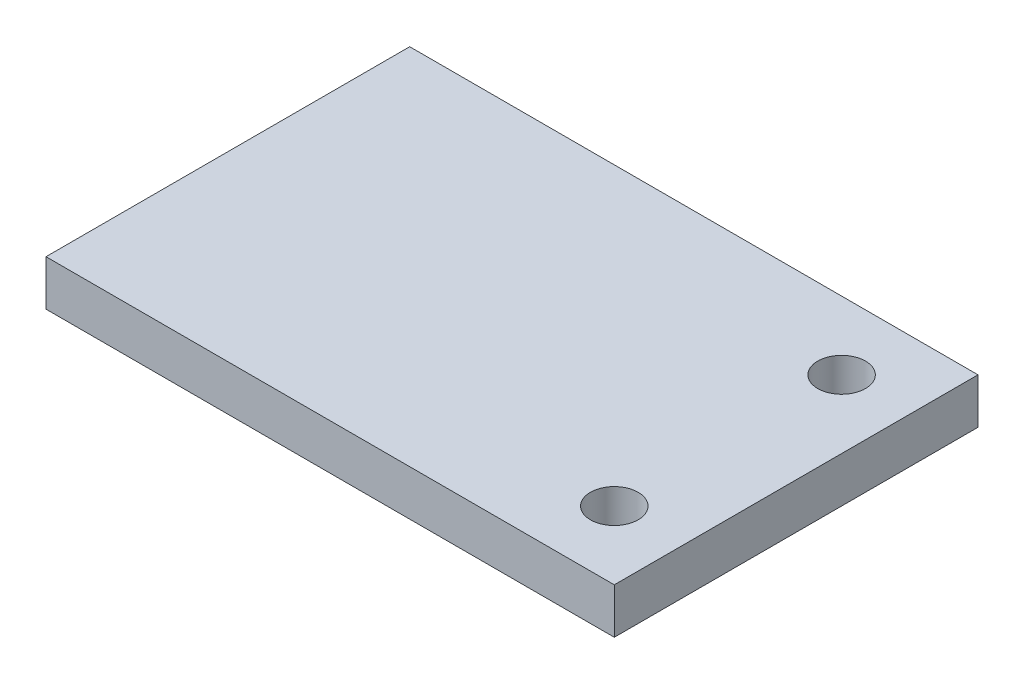
ISO-10303-21;
HEADER;
FILE_DESCRIPTION(('STEP AP214'),'2;1');
FILE_NAME('part.step','',(''),(''),'','','');
FILE_SCHEMA(('AUTOMOTIVE_DESIGN { 1 0 10303 214 1 1 1 1 }'));
ENDSEC;
DATA;
#1=APPLICATION_CONTEXT('core data for automotive mechanical design processes');
#2=APPLICATION_PROTOCOL_DEFINITION('international standard','automotive_design',2000,#1);
#3=PRODUCT_CONTEXT('',#1,'mechanical');
#4=PRODUCT('Part','Part','',(#3));
#5=PRODUCT_RELATED_PRODUCT_CATEGORY('part','',(#4));
#6=PRODUCT_DEFINITION_FORMATION('','',#4);
#7=PRODUCT_DEFINITION_CONTEXT('part definition',#1,'design');
#8=PRODUCT_DEFINITION('design','',#6,#7);
#9=PRODUCT_DEFINITION_SHAPE('','',#8);
#10=(LENGTH_UNIT() NAMED_UNIT(*) SI_UNIT(.MILLI.,.METRE.));
#11=(NAMED_UNIT(*) PLANE_ANGLE_UNIT() SI_UNIT($,.RADIAN.));
#12=(NAMED_UNIT(*) SI_UNIT($,.STERADIAN.) SOLID_ANGLE_UNIT());
#13=UNCERTAINTY_MEASURE_WITH_UNIT(LENGTH_MEASURE(1.E-05),#10,'distance_accuracy_value','');
#14=(GEOMETRIC_REPRESENTATION_CONTEXT(3) GLOBAL_UNCERTAINTY_ASSIGNED_CONTEXT((#13)) GLOBAL_UNIT_ASSIGNED_CONTEXT((#10,
#11,#12)) REPRESENTATION_CONTEXT('',''));
#15=CARTESIAN_POINT('',(0.,0.,0.));
#16=DIRECTION('',(0.,0.,1.));
#17=DIRECTION('',(1.,0.,0.));
#18=AXIS2_PLACEMENT_3D('',#15,#16,#17);
#19=CARTESIAN_POINT('',(0.,10.,0.));
#20=DIRECTION('',(0.,-1.,0.));
#21=DIRECTION('',(0.,0.,-1.));
#22=AXIS2_PLACEMENT_3D('',#19,#20,#21);
#23=PLANE('',#22);
#24=DIRECTION('',(0.,0.,1.));
#25=VECTOR('',#24,1.);
#26=CARTESIAN_POINT('',(-10.,10.,15.));
#27=LINE('',#26,#25);
#28=CARTESIAN_POINT('',(-10.,10.,-65.));
#29=VERTEX_POINT('',#28);
#30=CARTESIAN_POINT('',(-10.,10.,15.));
#31=VERTEX_POINT('',#30);
#32=EDGE_CURVE('E84',#29,#31,#27,.T.);
#33=ORIENTED_EDGE('',*,*,#32,.T.);
#34=DIRECTION('',(1.,0.,0.));
#35=VECTOR('',#34,1.);
#36=CARTESIAN_POINT('',(-10.,10.,15.));
#37=LINE('',#36,#35);
#38=CARTESIAN_POINT('',(115.,10.,15.));
#39=VERTEX_POINT('',#38);
#40=EDGE_CURVE('E79',#31,#39,#37,.T.);
#41=ORIENTED_EDGE('',*,*,#40,.T.);
#42=DIRECTION('',(0.,0.,-1.));
#43=VECTOR('',#42,1.);
#44=CARTESIAN_POINT('',(115.,10.,15.));
#45=LINE('',#44,#43);
#46=CARTESIAN_POINT('',(115.,10.,-65.));
#47=VERTEX_POINT('',#46);
#48=EDGE_CURVE('E82',#39,#47,#45,.T.);
#49=ORIENTED_EDGE('',*,*,#48,.T.);
#50=DIRECTION('',(-1.,0.,0.));
#51=VECTOR('',#50,1.);
#52=CARTESIAN_POINT('',(-10.,10.,-65.));
#53=LINE('',#52,#51);
#54=EDGE_CURVE('E49',#47,#29,#53,.T.);
#55=ORIENTED_EDGE('',*,*,#54,.T.);
#56=EDGE_LOOP('',(#33,#41,#49,#55));
#57=FACE_BOUND('',#56,.T.);
#58=CARTESIAN_POINT('',(100.,10.,-50.));
#59=DIRECTION('',(0.,1.,0.));
#60=DIRECTION('',(0.,0.,1.));
#61=AXIS2_PLACEMENT_3D('',#58,#59,#60);
#62=CIRCLE('',#61,5.25);
#63=CARTESIAN_POINT('',(100.,10.,-44.75));
#64=VERTEX_POINT('',#63);
#65=EDGE_CURVE('E99',#64,#64,#62,.T.);
#66=ORIENTED_EDGE('',*,*,#65,.F.);
#67=EDGE_LOOP('',(#66));
#68=FACE_BOUND('',#67,.T.);
#69=CARTESIAN_POINT('',(100.,10.,0.));
#70=DIRECTION('',(0.,1.,0.));
#71=DIRECTION('',(0.,0.,1.));
#72=AXIS2_PLACEMENT_3D('',#69,#70,#71);
#73=CIRCLE('',#72,5.25);
#74=CARTESIAN_POINT('',(100.,10.,5.25));
#75=VERTEX_POINT('',#74);
#76=EDGE_CURVE('E114',#75,#75,#73,.T.);
#77=ORIENTED_EDGE('',*,*,#76,.F.);
#78=EDGE_LOOP('',(#77));
#79=FACE_BOUND('',#78,.T.);
#80=ADVANCED_FACE('F32',(#57,#68,#79),#23,.F.);
#81=CARTESIAN_POINT('',(0.,0.,0.));
#82=DIRECTION('',(0.,-1.,0.));
#83=DIRECTION('',(0.,0.,-1.));
#84=AXIS2_PLACEMENT_3D('',#81,#82,#83);
#85=PLANE('',#84);
#86=CARTESIAN_POINT('',(100.,0.,-50.));
#87=DIRECTION('',(0.,1.,0.));
#88=DIRECTION('',(0.,0.,1.));
#89=AXIS2_PLACEMENT_3D('',#86,#87,#88);
#90=CIRCLE('',#89,5.25);
#91=CARTESIAN_POINT('',(100.,0.,-44.75));
#92=VERTEX_POINT('',#91);
#93=EDGE_CURVE('E111',#92,#92,#90,.T.);
#94=ORIENTED_EDGE('',*,*,#93,.T.);
#95=EDGE_LOOP('',(#94));
#96=FACE_BOUND('',#95,.T.);
#97=DIRECTION('',(0.,0.,1.));
#98=VECTOR('',#97,1.);
#99=CARTESIAN_POINT('',(-10.,0.,15.));
#100=LINE('',#99,#98);
#101=CARTESIAN_POINT('',(-10.,0.,-65.));
#102=VERTEX_POINT('',#101);
#103=CARTESIAN_POINT('',(-10.,0.,15.));
#104=VERTEX_POINT('',#103);
#105=EDGE_CURVE('E96',#102,#104,#100,.T.);
#106=ORIENTED_EDGE('',*,*,#105,.F.);
#107=DIRECTION('',(-1.,0.,0.));
#108=VECTOR('',#107,1.);
#109=CARTESIAN_POINT('',(-10.,0.,-65.));
#110=LINE('',#109,#108);
#111=CARTESIAN_POINT('',(115.,0.,-65.));
#112=VERTEX_POINT('',#111);
#113=EDGE_CURVE('E72',#112,#102,#110,.T.);
#114=ORIENTED_EDGE('',*,*,#113,.F.);
#115=DIRECTION('',(0.,0.,-1.));
#116=VECTOR('',#115,1.);
#117=CARTESIAN_POINT('',(115.,0.,15.));
#118=LINE('',#117,#116);
#119=CARTESIAN_POINT('',(115.,0.,15.));
#120=VERTEX_POINT('',#119);
#121=EDGE_CURVE('E66',#120,#112,#118,.T.);
#122=ORIENTED_EDGE('',*,*,#121,.F.);
#123=DIRECTION('',(1.,0.,0.));
#124=VECTOR('',#123,1.);
#125=CARTESIAN_POINT('',(-10.,0.,15.));
#126=LINE('',#125,#124);
#127=EDGE_CURVE('E88',#104,#120,#126,.T.);
#128=ORIENTED_EDGE('',*,*,#127,.F.);
#129=EDGE_LOOP('',(#106,#114,#122,#128));
#130=FACE_BOUND('',#129,.T.);
#131=CARTESIAN_POINT('',(100.,0.,0.));
#132=DIRECTION('',(0.,1.,0.));
#133=DIRECTION('',(0.,0.,1.));
#134=AXIS2_PLACEMENT_3D('',#131,#132,#133);
#135=CIRCLE('',#134,5.25);
#136=CARTESIAN_POINT('',(100.,0.,5.25));
#137=VERTEX_POINT('',#136);
#138=EDGE_CURVE('E117',#137,#137,#135,.T.);
#139=ORIENTED_EDGE('',*,*,#138,.T.);
#140=EDGE_LOOP('',(#139));
#141=FACE_BOUND('',#140,.T.);
#142=ADVANCED_FACE('F107',(#96,#130,#141),#85,.T.);
#143=CARTESIAN_POINT('',(-10.,10.,15.));
#144=DIRECTION('',(1.,0.,0.));
#145=DIRECTION('',(0.,0.,-1.));
#146=AXIS2_PLACEMENT_3D('',#143,#144,#145);
#147=PLANE('',#146);
#148=ORIENTED_EDGE('',*,*,#105,.T.);
#149=DIRECTION('',(0.,-1.,0.));
#150=VECTOR('',#149,1.);
#151=CARTESIAN_POINT('',(-10.,10.,15.));
#152=LINE('',#151,#150);
#153=EDGE_CURVE('E11',#31,#104,#152,.T.);
#154=ORIENTED_EDGE('',*,*,#153,.F.);
#155=ORIENTED_EDGE('',*,*,#32,.F.);
#156=DIRECTION('',(0.,-1.,0.));
#157=VECTOR('',#156,1.);
#158=CARTESIAN_POINT('',(-10.,10.,-65.));
#159=LINE('',#158,#157);
#160=EDGE_CURVE('E92',#29,#102,#159,.T.);
#161=ORIENTED_EDGE('',*,*,#160,.T.);
#162=EDGE_LOOP('',(#148,#154,#155,#161));
#163=FACE_BOUND('',#162,.T.);
#164=ADVANCED_FACE('F34',(#163),#147,.F.);
#165=CARTESIAN_POINT('',(-10.,10.,15.));
#166=DIRECTION('',(0.,0.,-1.));
#167=DIRECTION('',(-1.,0.,0.));
#168=AXIS2_PLACEMENT_3D('',#165,#166,#167);
#169=PLANE('',#168);
#170=ORIENTED_EDGE('',*,*,#127,.T.);
#171=DIRECTION('',(0.,-1.,0.));
#172=VECTOR('',#171,1.);
#173=CARTESIAN_POINT('',(115.,10.,15.));
#174=LINE('',#173,#172);
#175=EDGE_CURVE('E41',#39,#120,#174,.T.);
#176=ORIENTED_EDGE('',*,*,#175,.F.);
#177=ORIENTED_EDGE('',*,*,#40,.F.);
#178=ORIENTED_EDGE('',*,*,#153,.T.);
#179=EDGE_LOOP('',(#170,#176,#177,#178));
#180=FACE_BOUND('',#179,.T.);
#181=ADVANCED_FACE('F87',(#180),#169,.F.);
#182=CARTESIAN_POINT('',(115.,10.,15.));
#183=DIRECTION('',(-1.,0.,0.));
#184=DIRECTION('',(0.,0.,1.));
#185=AXIS2_PLACEMENT_3D('',#182,#183,#184);
#186=PLANE('',#185);
#187=ORIENTED_EDGE('',*,*,#121,.T.);
#188=DIRECTION('',(0.,-1.,0.));
#189=VECTOR('',#188,1.);
#190=CARTESIAN_POINT('',(115.,10.,-65.));
#191=LINE('',#190,#189);
#192=EDGE_CURVE('E89',#47,#112,#191,.T.);
#193=ORIENTED_EDGE('',*,*,#192,.F.);
#194=ORIENTED_EDGE('',*,*,#48,.F.);
#195=ORIENTED_EDGE('',*,*,#175,.T.);
#196=EDGE_LOOP('',(#187,#193,#194,#195));
#197=FACE_BOUND('',#196,.T.);
#198=ADVANCED_FACE('F90',(#197),#186,.F.);
#199=CARTESIAN_POINT('',(-10.,10.,-65.));
#200=DIRECTION('',(0.,0.,1.));
#201=DIRECTION('',(1.,0.,0.));
#202=AXIS2_PLACEMENT_3D('',#199,#200,#201);
#203=PLANE('',#202);
#204=ORIENTED_EDGE('',*,*,#113,.T.);
#205=ORIENTED_EDGE('',*,*,#160,.F.);
#206=ORIENTED_EDGE('',*,*,#54,.F.);
#207=ORIENTED_EDGE('',*,*,#192,.T.);
#208=EDGE_LOOP('',(#204,#205,#206,#207));
#209=FACE_BOUND('',#208,.T.);
#210=ADVANCED_FACE('F104',(#209),#203,.F.);
#211=CARTESIAN_POINT('',(100.,10.,-50.));
#212=DIRECTION('',(0.,-1.,0.));
#213=DIRECTION('',(0.,0.,-1.));
#214=AXIS2_PLACEMENT_3D('',#211,#212,#213);
#215=CYLINDRICAL_SURFACE('',#214,5.25);
#216=ORIENTED_EDGE('',*,*,#65,.T.);
#217=EDGE_LOOP('',(#216));
#218=FACE_BOUND('',#217,.T.);
#219=ORIENTED_EDGE('',*,*,#93,.F.);
#220=EDGE_LOOP('',(#219));
#221=FACE_BOUND('',#220,.T.);
#222=ADVANCED_FACE('F134',(#218,#221),#215,.F.);
#223=CARTESIAN_POINT('',(100.,10.,0.));
#224=DIRECTION('',(0.,-1.,0.));
#225=DIRECTION('',(0.,0.,-1.));
#226=AXIS2_PLACEMENT_3D('',#223,#224,#225);
#227=CYLINDRICAL_SURFACE('',#226,5.25);
#228=ORIENTED_EDGE('',*,*,#76,.T.);
#229=EDGE_LOOP('',(#228));
#230=FACE_BOUND('',#229,.T.);
#231=ORIENTED_EDGE('',*,*,#138,.F.);
#232=EDGE_LOOP('',(#231));
#233=FACE_BOUND('',#232,.T.);
#234=ADVANCED_FACE('F123',(#230,#233),#227,.F.);
#235=CLOSED_SHELL('',(#80,#142,#164,#181,#198,#210,#222,#234));
#236=MANIFOLD_SOLID_BREP('B2',#235);
#237=ADVANCED_BREP_SHAPE_REPRESENTATION('',(#18,#236),#14);
#238=SHAPE_DEFINITION_REPRESENTATION(#9,#237);
ENDSEC;
END-ISO-10303-21;
